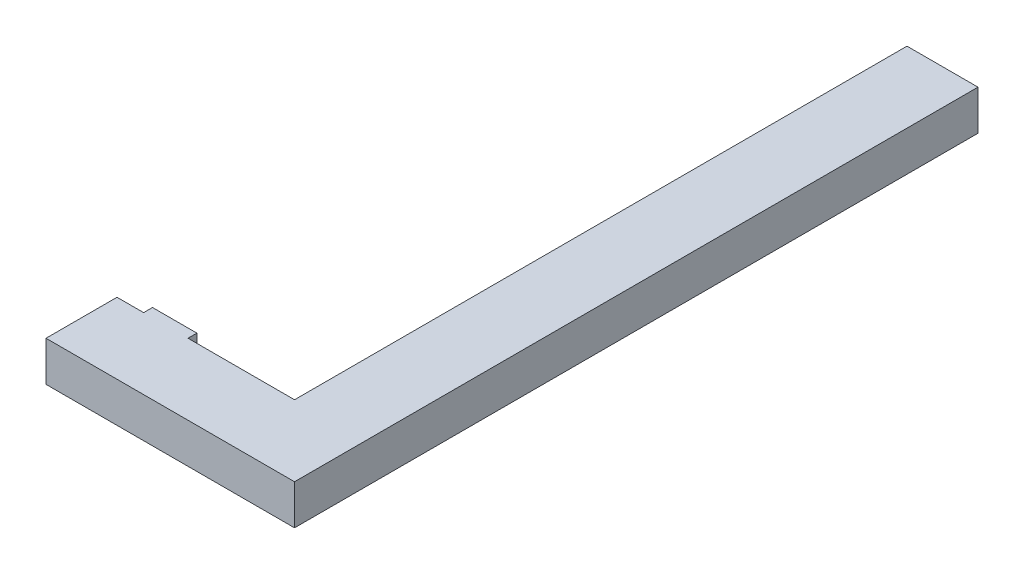
ISO-10303-21;
HEADER;
FILE_DESCRIPTION(('STEP AP214'),'2;1');
FILE_NAME('part.step','',(''),(''),'','','');
FILE_SCHEMA(('AUTOMOTIVE_DESIGN { 1 0 10303 214 1 1 1 1 }'));
ENDSEC;
DATA;
#1=APPLICATION_CONTEXT('core data for automotive mechanical design processes');
#2=APPLICATION_PROTOCOL_DEFINITION('international standard','automotive_design',2000,#1);
#3=PRODUCT_CONTEXT('',#1,'mechanical');
#4=PRODUCT('Part','Part','',(#3));
#5=PRODUCT_RELATED_PRODUCT_CATEGORY('part','',(#4));
#6=PRODUCT_DEFINITION_FORMATION('','',#4);
#7=PRODUCT_DEFINITION_CONTEXT('part definition',#1,'design');
#8=PRODUCT_DEFINITION('design','',#6,#7);
#9=PRODUCT_DEFINITION_SHAPE('','',#8);
#10=(LENGTH_UNIT() NAMED_UNIT(*) SI_UNIT(.MILLI.,.METRE.));
#11=(NAMED_UNIT(*) PLANE_ANGLE_UNIT() SI_UNIT($,.RADIAN.));
#12=(NAMED_UNIT(*) SI_UNIT($,.STERADIAN.) SOLID_ANGLE_UNIT());
#13=UNCERTAINTY_MEASURE_WITH_UNIT(LENGTH_MEASURE(1.E-05),#10,'distance_accuracy_value','');
#14=(GEOMETRIC_REPRESENTATION_CONTEXT(3) GLOBAL_UNCERTAINTY_ASSIGNED_CONTEXT((#13)) GLOBAL_UNIT_ASSIGNED_CONTEXT((#10,
#11,#12)) REPRESENTATION_CONTEXT('',''));
#15=CARTESIAN_POINT('',(0.,0.,0.));
#16=DIRECTION('',(0.,0.,1.));
#17=DIRECTION('',(1.,0.,0.));
#18=AXIS2_PLACEMENT_3D('',#15,#16,#17);
#19=CARTESIAN_POINT('',(4.722924528303,-0.225,1.426886792454));
#20=DIRECTION('',(0.,-1.,0.));
#21=DIRECTION('',(0.,0.,-1.));
#22=AXIS2_PLACEMENT_3D('',#19,#20,#21);
#23=PLANE('',#22);
#24=DIRECTION('',(0.,0.,1.));
#25=VECTOR('',#24,1.);
#26=CARTESIAN_POINT('',(5.48,-0.225,-3.1));
#27=LINE('',#26,#25);
#28=CARTESIAN_POINT('',(5.48,-0.225,-3.1));
#29=VERTEX_POINT('',#28);
#30=CARTESIAN_POINT('',(5.48,-0.225,4.6));
#31=VERTEX_POINT('',#30);
#32=EDGE_CURVE('E164',#29,#31,#27,.T.);
#33=ORIENTED_EDGE('',*,*,#32,.T.);
#34=DIRECTION('',(-1.,0.,0.));
#35=VECTOR('',#34,1.);
#36=CARTESIAN_POINT('',(5.48,-0.225,4.6));
#37=LINE('',#36,#35);
#38=CARTESIAN_POINT('',(2.68,-0.225,4.6));
#39=VERTEX_POINT('',#38);
#40=EDGE_CURVE('E201',#31,#39,#37,.T.);
#41=ORIENTED_EDGE('',*,*,#40,.T.);
#42=DIRECTION('',(0.,0.,-1.));
#43=VECTOR('',#42,1.);
#44=CARTESIAN_POINT('',(2.68,-0.225,4.6));
#45=LINE('',#44,#43);
#46=CARTESIAN_POINT('',(2.68,-0.225,3.800000000013));
#47=VERTEX_POINT('',#46);
#48=EDGE_CURVE('E154',#39,#47,#45,.T.);
#49=ORIENTED_EDGE('',*,*,#48,.T.);
#50=DIRECTION('',(1.,0.,0.));
#51=VECTOR('',#50,1.);
#52=CARTESIAN_POINT('',(2.68,-0.225,3.800000000013));
#53=LINE('',#52,#51);
#54=CARTESIAN_POINT('',(2.98,-0.225,3.800000000013));
#55=VERTEX_POINT('',#54);
#56=EDGE_CURVE('E143',#47,#55,#53,.T.);
#57=ORIENTED_EDGE('',*,*,#56,.T.);
#58=DIRECTION('',(0.,0.,-1.));
#59=VECTOR('',#58,1.);
#60=CARTESIAN_POINT('',(2.98,-0.225,3.800000000013));
#61=LINE('',#60,#59);
#62=CARTESIAN_POINT('',(2.98,-0.225,3.700000000013));
#63=VERTEX_POINT('',#62);
#64=EDGE_CURVE('E132',#55,#63,#61,.T.);
#65=ORIENTED_EDGE('',*,*,#64,.T.);
#66=DIRECTION('',(1.,0.,0.));
#67=VECTOR('',#66,1.);
#68=CARTESIAN_POINT('',(2.98,-0.225,3.700000000013));
#69=LINE('',#68,#67);
#70=CARTESIAN_POINT('',(3.48,-0.225,3.700000000013));
#71=VERTEX_POINT('',#70);
#72=EDGE_CURVE('E194',#63,#71,#69,.T.);
#73=ORIENTED_EDGE('',*,*,#72,.T.);
#74=DIRECTION('',(0.,0.,1.));
#75=VECTOR('',#74,1.);
#76=CARTESIAN_POINT('',(3.48,-0.225,3.700000000013));
#77=LINE('',#76,#75);
#78=CARTESIAN_POINT('',(3.48,-0.225,3.800000000013));
#79=VERTEX_POINT('',#78);
#80=EDGE_CURVE('E169',#71,#79,#77,.T.);
#81=ORIENTED_EDGE('',*,*,#80,.T.);
#82=DIRECTION('',(1.,0.,0.));
#83=VECTOR('',#82,1.);
#84=CARTESIAN_POINT('',(3.48,-0.225,3.800000000013));
#85=LINE('',#84,#83);
#86=CARTESIAN_POINT('',(4.68,-0.225,3.800000000013));
#87=VERTEX_POINT('',#86);
#88=EDGE_CURVE('E173',#79,#87,#85,.T.);
#89=ORIENTED_EDGE('',*,*,#88,.T.);
#90=DIRECTION('',(0.,0.,-1.));
#91=VECTOR('',#90,1.);
#92=CARTESIAN_POINT('',(4.68,-0.225,3.800000000013));
#93=LINE('',#92,#91);
#94=CARTESIAN_POINT('',(4.68,-0.225,-3.1));
#95=VERTEX_POINT('',#94);
#96=EDGE_CURVE('E74',#87,#95,#93,.T.);
#97=ORIENTED_EDGE('',*,*,#96,.T.);
#98=DIRECTION('',(1.,0.,0.));
#99=VECTOR('',#98,1.);
#100=CARTESIAN_POINT('',(4.68,-0.225,-3.1));
#101=LINE('',#100,#99);
#102=EDGE_CURVE('E11',#95,#29,#101,.T.);
#103=ORIENTED_EDGE('',*,*,#102,.T.);
#104=EDGE_LOOP('',(#33,#41,#49,#57,#65,#73,#81,#89,#97,#103));
#105=FACE_BOUND('',#104,.T.);
#106=ADVANCED_FACE('F16',(#105),#23,.T.);
#107=CARTESIAN_POINT('',(4.722924528303,0.225,1.426886792454));
#108=DIRECTION('',(0.,-1.,0.));
#109=DIRECTION('',(0.,0.,-1.));
#110=AXIS2_PLACEMENT_3D('',#107,#108,#109);
#111=PLANE('',#110);
#112=DIRECTION('',(1.,0.,0.));
#113=VECTOR('',#112,1.);
#114=CARTESIAN_POINT('',(4.68,0.225,-3.1));
#115=LINE('',#114,#113);
#116=CARTESIAN_POINT('',(4.68,0.225,-3.1));
#117=VERTEX_POINT('',#116);
#118=CARTESIAN_POINT('',(5.48,0.225,-3.1));
#119=VERTEX_POINT('',#118);
#120=EDGE_CURVE('E27',#117,#119,#115,.T.);
#121=ORIENTED_EDGE('',*,*,#120,.F.);
#122=DIRECTION('',(0.,0.,-1.));
#123=VECTOR('',#122,1.);
#124=CARTESIAN_POINT('',(4.68,0.225,3.800000000013));
#125=LINE('',#124,#123);
#126=CARTESIAN_POINT('',(4.68,0.225,3.800000000013));
#127=VERTEX_POINT('',#126);
#128=EDGE_CURVE('E86',#127,#117,#125,.T.);
#129=ORIENTED_EDGE('',*,*,#128,.F.);
#130=DIRECTION('',(1.,0.,0.));
#131=VECTOR('',#130,1.);
#132=CARTESIAN_POINT('',(3.48,0.225,3.800000000013));
#133=LINE('',#132,#131);
#134=CARTESIAN_POINT('',(3.48,0.225,3.800000000013));
#135=VERTEX_POINT('',#134);
#136=EDGE_CURVE('E180',#135,#127,#133,.T.);
#137=ORIENTED_EDGE('',*,*,#136,.F.);
#138=DIRECTION('',(0.,0.,1.));
#139=VECTOR('',#138,1.);
#140=CARTESIAN_POINT('',(3.48,0.225,3.700000000013));
#141=LINE('',#140,#139);
#142=CARTESIAN_POINT('',(3.48,0.225,3.700000000013));
#143=VERTEX_POINT('',#142);
#144=EDGE_CURVE('E20',#143,#135,#141,.T.);
#145=ORIENTED_EDGE('',*,*,#144,.F.);
#146=DIRECTION('',(1.,0.,0.));
#147=VECTOR('',#146,1.);
#148=CARTESIAN_POINT('',(2.98,0.225,3.700000000013));
#149=LINE('',#148,#147);
#150=CARTESIAN_POINT('',(2.98,0.225,3.700000000013));
#151=VERTEX_POINT('',#150);
#152=EDGE_CURVE('E121',#151,#143,#149,.T.);
#153=ORIENTED_EDGE('',*,*,#152,.F.);
#154=DIRECTION('',(0.,0.,-1.));
#155=VECTOR('',#154,1.);
#156=CARTESIAN_POINT('',(2.98,0.225,3.800000000013));
#157=LINE('',#156,#155);
#158=CARTESIAN_POINT('',(2.98,0.225,3.800000000013));
#159=VERTEX_POINT('',#158);
#160=EDGE_CURVE('E136',#159,#151,#157,.T.);
#161=ORIENTED_EDGE('',*,*,#160,.F.);
#162=DIRECTION('',(1.,0.,0.));
#163=VECTOR('',#162,1.);
#164=CARTESIAN_POINT('',(2.68,0.225,3.800000000013));
#165=LINE('',#164,#163);
#166=CARTESIAN_POINT('',(2.68,0.225,3.800000000013));
#167=VERTEX_POINT('',#166);
#168=EDGE_CURVE('E139',#167,#159,#165,.T.);
#169=ORIENTED_EDGE('',*,*,#168,.F.);
#170=DIRECTION('',(0.,0.,-1.));
#171=VECTOR('',#170,1.);
#172=CARTESIAN_POINT('',(2.68,0.225,4.6));
#173=LINE('',#172,#171);
#174=CARTESIAN_POINT('',(2.68,0.225,4.6));
#175=VERTEX_POINT('',#174);
#176=EDGE_CURVE('E112',#175,#167,#173,.T.);
#177=ORIENTED_EDGE('',*,*,#176,.F.);
#178=DIRECTION('',(-1.,0.,0.));
#179=VECTOR('',#178,1.);
#180=CARTESIAN_POINT('',(5.48,0.225,4.6));
#181=LINE('',#180,#179);
#182=CARTESIAN_POINT('',(5.48,0.225,4.6));
#183=VERTEX_POINT('',#182);
#184=EDGE_CURVE('E214',#183,#175,#181,.T.);
#185=ORIENTED_EDGE('',*,*,#184,.F.);
#186=DIRECTION('',(0.,0.,1.));
#187=VECTOR('',#186,1.);
#188=CARTESIAN_POINT('',(5.48,0.225,-3.1));
#189=LINE('',#188,#187);
#190=EDGE_CURVE('E188',#119,#183,#189,.T.);
#191=ORIENTED_EDGE('',*,*,#190,.F.);
#192=EDGE_LOOP('',(#121,#129,#137,#145,#153,#161,#169,#177,#185,#191));
#193=FACE_BOUND('',#192,.T.);
#194=ADVANCED_FACE('F137',(#193),#111,.F.);
#195=CARTESIAN_POINT('',(4.68,0.225,-3.1));
#196=DIRECTION('',(0.,0.,1.));
#197=DIRECTION('',(0.,-1.,0.));
#198=AXIS2_PLACEMENT_3D('',#195,#196,#197);
#199=PLANE('',#198);
#200=ORIENTED_EDGE('',*,*,#120,.T.);
#201=DIRECTION('',(0.,-1.,0.));
#202=VECTOR('',#201,1.);
#203=CARTESIAN_POINT('',(5.48,0.225,-3.1));
#204=LINE('',#203,#202);
#205=EDGE_CURVE('E224',#119,#29,#204,.T.);
#206=ORIENTED_EDGE('',*,*,#205,.T.);
#207=ORIENTED_EDGE('',*,*,#102,.F.);
#208=DIRECTION('',(0.,-1.,0.));
#209=VECTOR('',#208,1.);
#210=CARTESIAN_POINT('',(4.68,0.225,-3.1));
#211=LINE('',#210,#209);
#212=EDGE_CURVE('E172',#117,#95,#211,.T.);
#213=ORIENTED_EDGE('',*,*,#212,.F.);
#214=EDGE_LOOP('',(#200,#206,#207,#213));
#215=FACE_BOUND('',#214,.T.);
#216=ADVANCED_FACE('F333',(#215),#199,.F.);
#217=CARTESIAN_POINT('',(4.68,0.225,3.800000000013));
#218=DIRECTION('',(1.,0.,0.));
#219=DIRECTION('',(0.,1.,0.));
#220=AXIS2_PLACEMENT_3D('',#217,#218,#219);
#221=PLANE('',#220);
#222=ORIENTED_EDGE('',*,*,#128,.T.);
#223=ORIENTED_EDGE('',*,*,#212,.T.);
#224=ORIENTED_EDGE('',*,*,#96,.F.);
#225=DIRECTION('',(0.,-1.,0.));
#226=VECTOR('',#225,1.);
#227=CARTESIAN_POINT('',(4.68,0.225,3.800000000013));
#228=LINE('',#227,#226);
#229=EDGE_CURVE('E176',#127,#87,#228,.T.);
#230=ORIENTED_EDGE('',*,*,#229,.F.);
#231=EDGE_LOOP('',(#222,#223,#224,#230));
#232=FACE_BOUND('',#231,.T.);
#233=ADVANCED_FACE('F338',(#232),#221,.F.);
#234=CARTESIAN_POINT('',(3.48,0.225,3.800000000013));
#235=DIRECTION('',(0.,0.,1.));
#236=DIRECTION('',(0.,-1.,0.));
#237=AXIS2_PLACEMENT_3D('',#234,#235,#236);
#238=PLANE('',#237);
#239=ORIENTED_EDGE('',*,*,#136,.T.);
#240=ORIENTED_EDGE('',*,*,#229,.T.);
#241=ORIENTED_EDGE('',*,*,#88,.F.);
#242=DIRECTION('',(0.,-1.,0.));
#243=VECTOR('',#242,1.);
#244=CARTESIAN_POINT('',(3.48,0.225,3.800000000013));
#245=LINE('',#244,#243);
#246=EDGE_CURVE('E165',#135,#79,#245,.T.);
#247=ORIENTED_EDGE('',*,*,#246,.F.);
#248=EDGE_LOOP('',(#239,#240,#241,#247));
#249=FACE_BOUND('',#248,.T.);
#250=ADVANCED_FACE('F343',(#249),#238,.F.);
#251=CARTESIAN_POINT('',(3.48,0.225,3.700000000013));
#252=DIRECTION('',(-1.,0.,0.));
#253=DIRECTION('',(0.,0.,1.));
#254=AXIS2_PLACEMENT_3D('',#251,#252,#253);
#255=PLANE('',#254);
#256=ORIENTED_EDGE('',*,*,#144,.T.);
#257=ORIENTED_EDGE('',*,*,#246,.T.);
#258=ORIENTED_EDGE('',*,*,#80,.F.);
#259=DIRECTION('',(0.,-1.,0.));
#260=VECTOR('',#259,1.);
#261=CARTESIAN_POINT('',(3.48,0.225,3.700000000013));
#262=LINE('',#261,#260);
#263=EDGE_CURVE('E198',#143,#71,#262,.T.);
#264=ORIENTED_EDGE('',*,*,#263,.F.);
#265=EDGE_LOOP('',(#256,#257,#258,#264));
#266=FACE_BOUND('',#265,.T.);
#267=ADVANCED_FACE('F348',(#266),#255,.F.);
#268=CARTESIAN_POINT('',(2.98,0.225,3.700000000013));
#269=DIRECTION('',(0.,0.,1.));
#270=DIRECTION('',(0.,-1.,0.));
#271=AXIS2_PLACEMENT_3D('',#268,#269,#270);
#272=PLANE('',#271);
#273=ORIENTED_EDGE('',*,*,#152,.T.);
#274=ORIENTED_EDGE('',*,*,#263,.T.);
#275=ORIENTED_EDGE('',*,*,#72,.F.);
#276=DIRECTION('',(0.,-1.,0.));
#277=VECTOR('',#276,1.);
#278=CARTESIAN_POINT('',(2.98,0.225,3.700000000013));
#279=LINE('',#278,#277);
#280=EDGE_CURVE('E142',#151,#63,#279,.T.);
#281=ORIENTED_EDGE('',*,*,#280,.F.);
#282=EDGE_LOOP('',(#273,#274,#275,#281));
#283=FACE_BOUND('',#282,.T.);
#284=ADVANCED_FACE('F379',(#283),#272,.F.);
#285=CARTESIAN_POINT('',(2.98,0.225,3.800000000013));
#286=DIRECTION('',(1.,0.,0.));
#287=DIRECTION('',(0.,1.,0.));
#288=AXIS2_PLACEMENT_3D('',#285,#286,#287);
#289=PLANE('',#288);
#290=ORIENTED_EDGE('',*,*,#160,.T.);
#291=ORIENTED_EDGE('',*,*,#280,.T.);
#292=ORIENTED_EDGE('',*,*,#64,.F.);
#293=DIRECTION('',(0.,-1.,0.));
#294=VECTOR('',#293,1.);
#295=CARTESIAN_POINT('',(2.98,0.225,3.800000000013));
#296=LINE('',#295,#294);
#297=EDGE_CURVE('E146',#159,#55,#296,.T.);
#298=ORIENTED_EDGE('',*,*,#297,.F.);
#299=EDGE_LOOP('',(#290,#291,#292,#298));
#300=FACE_BOUND('',#299,.T.);
#301=ADVANCED_FACE('F18',(#300),#289,.F.);
#302=CARTESIAN_POINT('',(2.68,0.225,3.800000000013));
#303=DIRECTION('',(0.,0.,1.));
#304=DIRECTION('',(0.,-1.,0.));
#305=AXIS2_PLACEMENT_3D('',#302,#303,#304);
#306=PLANE('',#305);
#307=ORIENTED_EDGE('',*,*,#168,.T.);
#308=ORIENTED_EDGE('',*,*,#297,.T.);
#309=ORIENTED_EDGE('',*,*,#56,.F.);
#310=DIRECTION('',(0.,-1.,0.));
#311=VECTOR('',#310,1.);
#312=CARTESIAN_POINT('',(2.68,0.225,3.800000000013));
#313=LINE('',#312,#311);
#314=EDGE_CURVE('E152',#167,#47,#313,.T.);
#315=ORIENTED_EDGE('',*,*,#314,.F.);
#316=EDGE_LOOP('',(#307,#308,#309,#315));
#317=FACE_BOUND('',#316,.T.);
#318=ADVANCED_FACE('F150',(#317),#306,.F.);
#319=CARTESIAN_POINT('',(2.68,0.225,4.6));
#320=DIRECTION('',(1.,0.,0.));
#321=DIRECTION('',(0.,1.,0.));
#322=AXIS2_PLACEMENT_3D('',#319,#320,#321);
#323=PLANE('',#322);
#324=ORIENTED_EDGE('',*,*,#176,.T.);
#325=ORIENTED_EDGE('',*,*,#314,.T.);
#326=ORIENTED_EDGE('',*,*,#48,.F.);
#327=DIRECTION('',(0.,-1.,0.));
#328=VECTOR('',#327,1.);
#329=CARTESIAN_POINT('',(2.68,0.225,4.6));
#330=LINE('',#329,#328);
#331=EDGE_CURVE('E210',#175,#39,#330,.T.);
#332=ORIENTED_EDGE('',*,*,#331,.F.);
#333=EDGE_LOOP('',(#324,#325,#326,#332));
#334=FACE_BOUND('',#333,.T.);
#335=ADVANCED_FACE('F241',(#334),#323,.F.);
#336=CARTESIAN_POINT('',(5.48,0.225,4.6));
#337=DIRECTION('',(0.,0.,-1.));
#338=DIRECTION('',(-1.,0.,0.));
#339=AXIS2_PLACEMENT_3D('',#336,#337,#338);
#340=PLANE('',#339);
#341=ORIENTED_EDGE('',*,*,#184,.T.);
#342=ORIENTED_EDGE('',*,*,#331,.T.);
#343=ORIENTED_EDGE('',*,*,#40,.F.);
#344=DIRECTION('',(0.,-1.,0.));
#345=VECTOR('',#344,1.);
#346=CARTESIAN_POINT('',(5.48,0.225,4.6));
#347=LINE('',#346,#345);
#348=EDGE_CURVE('E184',#183,#31,#347,.T.);
#349=ORIENTED_EDGE('',*,*,#348,.F.);
#350=EDGE_LOOP('',(#341,#342,#343,#349));
#351=FACE_BOUND('',#350,.T.);
#352=ADVANCED_FACE('F239',(#351),#340,.F.);
#353=CARTESIAN_POINT('',(5.48,0.225,-3.1));
#354=DIRECTION('',(-1.,0.,0.));
#355=DIRECTION('',(0.,0.,1.));
#356=AXIS2_PLACEMENT_3D('',#353,#354,#355);
#357=PLANE('',#356);
#358=ORIENTED_EDGE('',*,*,#190,.T.);
#359=ORIENTED_EDGE('',*,*,#348,.T.);
#360=ORIENTED_EDGE('',*,*,#32,.F.);
#361=ORIENTED_EDGE('',*,*,#205,.F.);
#362=EDGE_LOOP('',(#358,#359,#360,#361));
#363=FACE_BOUND('',#362,.T.);
#364=ADVANCED_FACE('F236',(#363),#357,.F.);
#365=CLOSED_SHELL('',(#106,#194,#216,#233,#250,#267,#284,#301,#318,#335,#352,#364));
#366=MANIFOLD_SOLID_BREP('B1',#365);
#367=ADVANCED_BREP_SHAPE_REPRESENTATION('',(#18,#366),#14);
#368=SHAPE_DEFINITION_REPRESENTATION(#9,#367);
ENDSEC;
END-ISO-10303-21;
